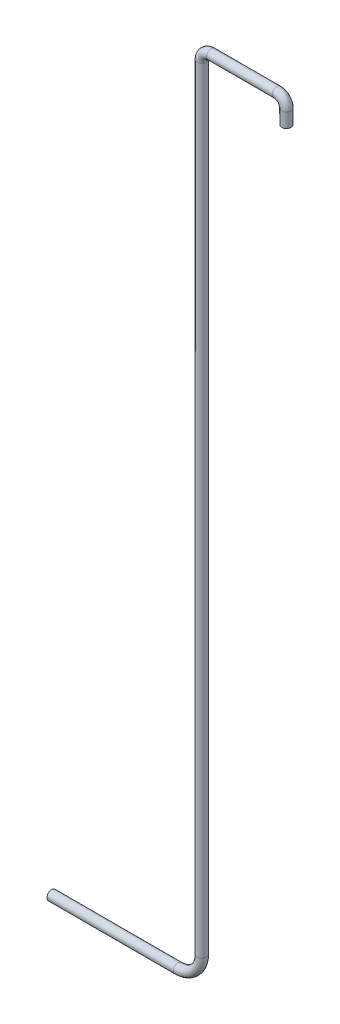
ISO-10303-21;
HEADER;
FILE_DESCRIPTION(('STEP AP214'),'2;1');
FILE_NAME('part.step','',(''),(''),'','','');
FILE_SCHEMA(('AUTOMOTIVE_DESIGN { 1 0 10303 214 1 1 1 1 }'));
ENDSEC;
DATA;
#1=APPLICATION_CONTEXT('core data for automotive mechanical design processes');
#2=APPLICATION_PROTOCOL_DEFINITION('international standard','automotive_design',2000,#1);
#3=PRODUCT_CONTEXT('',#1,'mechanical');
#4=PRODUCT('Part','Part','',(#3));
#5=PRODUCT_RELATED_PRODUCT_CATEGORY('part','',(#4));
#6=PRODUCT_DEFINITION_FORMATION('','',#4);
#7=PRODUCT_DEFINITION_CONTEXT('part definition',#1,'design');
#8=PRODUCT_DEFINITION('design','',#6,#7);
#9=PRODUCT_DEFINITION_SHAPE('','',#8);
#10=(LENGTH_UNIT() NAMED_UNIT(*) SI_UNIT(.MILLI.,.METRE.));
#11=(NAMED_UNIT(*) PLANE_ANGLE_UNIT() SI_UNIT($,.RADIAN.));
#12=(NAMED_UNIT(*) SI_UNIT($,.STERADIAN.) SOLID_ANGLE_UNIT());
#13=UNCERTAINTY_MEASURE_WITH_UNIT(LENGTH_MEASURE(1.E-05),#10,'distance_accuracy_value','');
#14=(GEOMETRIC_REPRESENTATION_CONTEXT(3) GLOBAL_UNCERTAINTY_ASSIGNED_CONTEXT((#13)) GLOBAL_UNIT_ASSIGNED_CONTEXT((#10,
#11,#12)) REPRESENTATION_CONTEXT('',''));
#15=CARTESIAN_POINT('',(0.,0.,0.));
#16=DIRECTION('',(0.,0.,1.));
#17=DIRECTION('',(1.,0.,0.));
#18=AXIS2_PLACEMENT_3D('',#15,#16,#17);
#19=CARTESIAN_POINT('',(-2.28453374132914,-16.55,0.));
#20=DIRECTION('',(-1.,0.,0.));
#21=DIRECTION('',(0.,0.,1.));
#22=AXIS2_PLACEMENT_3D('',#19,#20,#21);
#23=CYLINDRICAL_SURFACE('',#22,0.1);
#24=CARTESIAN_POINT('',(-2.28453374132914,-16.55,0.));
#25=DIRECTION('',(-1.,0.,0.));
#26=DIRECTION('',(0.,0.,1.));
#27=AXIS2_PLACEMENT_3D('',#24,#25,#26);
#28=CIRCLE('',#27,0.1);
#29=CARTESIAN_POINT('',(-2.28453374132914,-16.65,0.));
#30=VERTEX_POINT('',#29);
#31=EDGE_CURVE('E35',#30,#30,#28,.T.);
#32=ORIENTED_EDGE('',*,*,#31,.T.);
#33=EDGE_LOOP('',(#32));
#34=FACE_BOUND('',#33,.T.);
#35=CARTESIAN_POINT('',(-4.95453374132914,-16.55,0.));
#36=DIRECTION('',(-1.,0.,0.));
#37=DIRECTION('',(0.,0.,1.));
#38=AXIS2_PLACEMENT_3D('',#35,#36,#37);
#39=CIRCLE('',#38,0.1);
#40=CARTESIAN_POINT('',(-4.95453374132914,-16.55,0.1));
#41=VERTEX_POINT('',#40);
#42=EDGE_CURVE('E10',#41,#41,#39,.T.);
#43=ORIENTED_EDGE('',*,*,#42,.F.);
#44=EDGE_LOOP('',(#43));
#45=FACE_BOUND('',#44,.T.);
#46=ADVANCED_FACE('F29',(#34,#45),#23,.T.);
#47=CARTESIAN_POINT('',(-2.28453374132914,-16.05,0.));
#48=DIRECTION('',(0.,0.,-1.));
#49=DIRECTION('',(-1.,0.,0.));
#50=AXIS2_PLACEMENT_3D('',#47,#48,#49);
#51=TOROIDAL_SURFACE('',#50,0.5,0.1);
#52=CARTESIAN_POINT('',(-1.78453374132914,-16.05,0.));
#53=DIRECTION('',(0.,-1.,0.));
#54=DIRECTION('',(0.,0.,1.));
#55=AXIS2_PLACEMENT_3D('',#52,#53,#54);
#56=CIRCLE('',#55,0.1);
#57=CARTESIAN_POINT('',(-1.68453374132914,-16.05,0.));
#58=VERTEX_POINT('',#57);
#59=EDGE_CURVE('E39',#58,#58,#56,.T.);
#60=CARTESIAN_POINT('',(-2.28453374132914,-16.05,0.));
#61=DIRECTION('',(0.,0.,-1.));
#62=DIRECTION('',(-1.,0.,0.));
#63=AXIS2_PLACEMENT_3D('',#60,#61,#62);
#64=CIRCLE('',#63,0.6);
#65=EDGE_CURVE('',#58,#30,#64,.T.);
#66=ORIENTED_EDGE('',*,*,#59,.T.);
#67=ORIENTED_EDGE('',*,*,#31,.F.);
#68=ORIENTED_EDGE('',*,*,#65,.T.);
#69=ORIENTED_EDGE('',*,*,#65,.F.);
#70=EDGE_LOOP('',(#66,#68,#67,#69));
#71=FACE_BOUND('',#70,.T.);
#72=ADVANCED_FACE('F79',(#71),#51,.T.);
#73=CARTESIAN_POINT('',(-1.78453374132914,0.3,0.));
#74=DIRECTION('',(0.,-1.,0.));
#75=DIRECTION('',(1.,0.,0.));
#76=AXIS2_PLACEMENT_3D('',#73,#74,#75);
#77=CYLINDRICAL_SURFACE('',#76,0.1);
#78=CARTESIAN_POINT('',(-1.78453374132914,0.3,0.));
#79=DIRECTION('',(0.,-1.,0.));
#80=DIRECTION('',(0.,0.,1.));
#81=AXIS2_PLACEMENT_3D('',#78,#79,#80);
#82=CIRCLE('',#81,0.1);
#83=CARTESIAN_POINT('',(-1.88453374132914,0.3,0.));
#84=VERTEX_POINT('',#83);
#85=EDGE_CURVE('E43',#84,#84,#82,.T.);
#86=ORIENTED_EDGE('',*,*,#85,.T.);
#87=EDGE_LOOP('',(#86));
#88=FACE_BOUND('',#87,.T.);
#89=ORIENTED_EDGE('',*,*,#59,.F.);
#90=EDGE_LOOP('',(#89));
#91=FACE_BOUND('',#90,.T.);
#92=ADVANCED_FACE('F83',(#88,#91),#77,.T.);
#93=CARTESIAN_POINT('',(-1.58453374132914,0.3,0.));
#94=DIRECTION('',(0.,0.,1.));
#95=DIRECTION('',(1.,0.,0.));
#96=AXIS2_PLACEMENT_3D('',#93,#94,#95);
#97=TOROIDAL_SURFACE('',#96,0.2,0.1);
#98=CARTESIAN_POINT('',(-1.58453374132914,0.5,0.));
#99=DIRECTION('',(-1.,0.,0.));
#100=DIRECTION('',(0.,0.,1.));
#101=AXIS2_PLACEMENT_3D('',#98,#99,#100);
#102=CIRCLE('',#101,0.1);
#103=CARTESIAN_POINT('',(-1.58453374132914,0.6,0.));
#104=VERTEX_POINT('',#103);
#105=EDGE_CURVE('E48',#104,#104,#102,.T.);
#106=CARTESIAN_POINT('',(-1.58453374132914,0.3,0.));
#107=DIRECTION('',(0.,0.,1.));
#108=DIRECTION('',(1.,0.,0.));
#109=AXIS2_PLACEMENT_3D('',#106,#107,#108);
#110=CIRCLE('',#109,0.3);
#111=EDGE_CURVE('',#104,#84,#110,.T.);
#112=ORIENTED_EDGE('',*,*,#105,.T.);
#113=ORIENTED_EDGE('',*,*,#85,.F.);
#114=ORIENTED_EDGE('',*,*,#111,.T.);
#115=ORIENTED_EDGE('',*,*,#111,.F.);
#116=EDGE_LOOP('',(#112,#114,#113,#115));
#117=FACE_BOUND('',#116,.T.);
#118=ADVANCED_FACE('F89',(#117),#97,.T.);
#119=CARTESIAN_POINT('',(-0.200000000000001,0.5,0.));
#120=DIRECTION('',(-1.,0.,0.));
#121=DIRECTION('',(0.,-1.,0.));
#122=AXIS2_PLACEMENT_3D('',#119,#120,#121);
#123=CYLINDRICAL_SURFACE('',#122,0.1);
#124=CARTESIAN_POINT('',(-0.200000000000001,0.5,0.));
#125=DIRECTION('',(-1.,0.,0.));
#126=DIRECTION('',(0.,0.,1.));
#127=AXIS2_PLACEMENT_3D('',#124,#125,#126);
#128=CIRCLE('',#127,0.1);
#129=CARTESIAN_POINT('',(-0.200000000000002,0.6,0.));
#130=VERTEX_POINT('',#129);
#131=EDGE_CURVE('E51',#130,#130,#128,.T.);
#132=ORIENTED_EDGE('',*,*,#131,.T.);
#133=EDGE_LOOP('',(#132));
#134=FACE_BOUND('',#133,.T.);
#135=ORIENTED_EDGE('',*,*,#105,.F.);
#136=EDGE_LOOP('',(#135));
#137=FACE_BOUND('',#136,.T.);
#138=ADVANCED_FACE('F96',(#134,#137),#123,.T.);
#139=CARTESIAN_POINT('',(-0.2,0.3,0.));
#140=DIRECTION('',(0.,0.,1.));
#141=DIRECTION('',(1.,0.,0.));
#142=AXIS2_PLACEMENT_3D('',#139,#140,#141);
#143=TOROIDAL_SURFACE('',#142,0.2,0.1);
#144=CARTESIAN_POINT('',(0.,0.299999999999999,0.));
#145=DIRECTION('',(0.,1.,0.));
#146=DIRECTION('',(0.,0.,1.));
#147=AXIS2_PLACEMENT_3D('',#144,#145,#146);
#148=CIRCLE('',#147,0.1);
#149=CARTESIAN_POINT('',(0.1,0.299999999999998,0.));
#150=VERTEX_POINT('',#149);
#151=EDGE_CURVE('E54',#150,#150,#148,.T.);
#152=CARTESIAN_POINT('',(-0.2,0.3,0.));
#153=DIRECTION('',(0.,0.,1.));
#154=DIRECTION('',(1.,0.,0.));
#155=AXIS2_PLACEMENT_3D('',#152,#153,#154);
#156=CIRCLE('',#155,0.3);
#157=EDGE_CURVE('',#150,#130,#156,.T.);
#158=ORIENTED_EDGE('',*,*,#151,.T.);
#159=ORIENTED_EDGE('',*,*,#131,.F.);
#160=ORIENTED_EDGE('',*,*,#157,.T.);
#161=ORIENTED_EDGE('',*,*,#157,.F.);
#162=EDGE_LOOP('',(#158,#160,#159,#161));
#163=FACE_BOUND('',#162,.T.);
#164=ADVANCED_FACE('F61',(#163),#143,.T.);
#165=CARTESIAN_POINT('',(0.,0.299999999999999,0.));
#166=DIRECTION('',(0.,-1.,0.));
#167=DIRECTION('',(0.,0.,-1.));
#168=AXIS2_PLACEMENT_3D('',#165,#166,#167);
#169=CYLINDRICAL_SURFACE('',#168,0.1);
#170=ORIENTED_EDGE('',*,*,#151,.F.);
#171=EDGE_LOOP('',(#170));
#172=FACE_BOUND('',#171,.T.);
#173=CARTESIAN_POINT('',(0.,0.,0.));
#174=DIRECTION('',(0.,1.,0.));
#175=DIRECTION('',(0.,0.,1.));
#176=AXIS2_PLACEMENT_3D('',#173,#174,#175);
#177=CIRCLE('',#176,0.1);
#178=CARTESIAN_POINT('',(0.,0.,0.1));
#179=VERTEX_POINT('',#178);
#180=EDGE_CURVE('E55',#179,#179,#177,.T.);
#181=ORIENTED_EDGE('',*,*,#180,.T.);
#182=EDGE_LOOP('',(#181));
#183=FACE_BOUND('',#182,.T.);
#184=ADVANCED_FACE('F64',(#172,#183),#169,.T.);
#185=CARTESIAN_POINT('',(-4.95453374132914,-16.55,0.));
#186=DIRECTION('',(-1.,0.,0.));
#187=DIRECTION('',(0.,0.,1.));
#188=AXIS2_PLACEMENT_3D('',#185,#186,#187);
#189=PLANE('',#188);
#190=ORIENTED_EDGE('',*,*,#42,.T.);
#191=EDGE_LOOP('',(#190));
#192=FACE_BOUND('',#191,.T.);
#193=ADVANCED_FACE('F67',(#192),#189,.T.);
#194=CARTESIAN_POINT('',(0.,0.,0.));
#195=DIRECTION('',(0.,1.,0.));
#196=DIRECTION('',(0.,0.,1.));
#197=AXIS2_PLACEMENT_3D('',#194,#195,#196);
#198=PLANE('',#197);
#199=ORIENTED_EDGE('',*,*,#180,.F.);
#200=EDGE_LOOP('',(#199));
#201=FACE_BOUND('',#200,.T.);
#202=ADVANCED_FACE('F71',(#201),#198,.F.);
#203=CLOSED_SHELL('',(#46,#72,#92,#118,#138,#164,#184,#193,#202));
#204=MANIFOLD_SOLID_BREP('B2',#203);
#205=ADVANCED_BREP_SHAPE_REPRESENTATION('',(#18,#204),#14);
#206=SHAPE_DEFINITION_REPRESENTATION(#9,#205);
ENDSEC;
END-ISO-10303-21;
